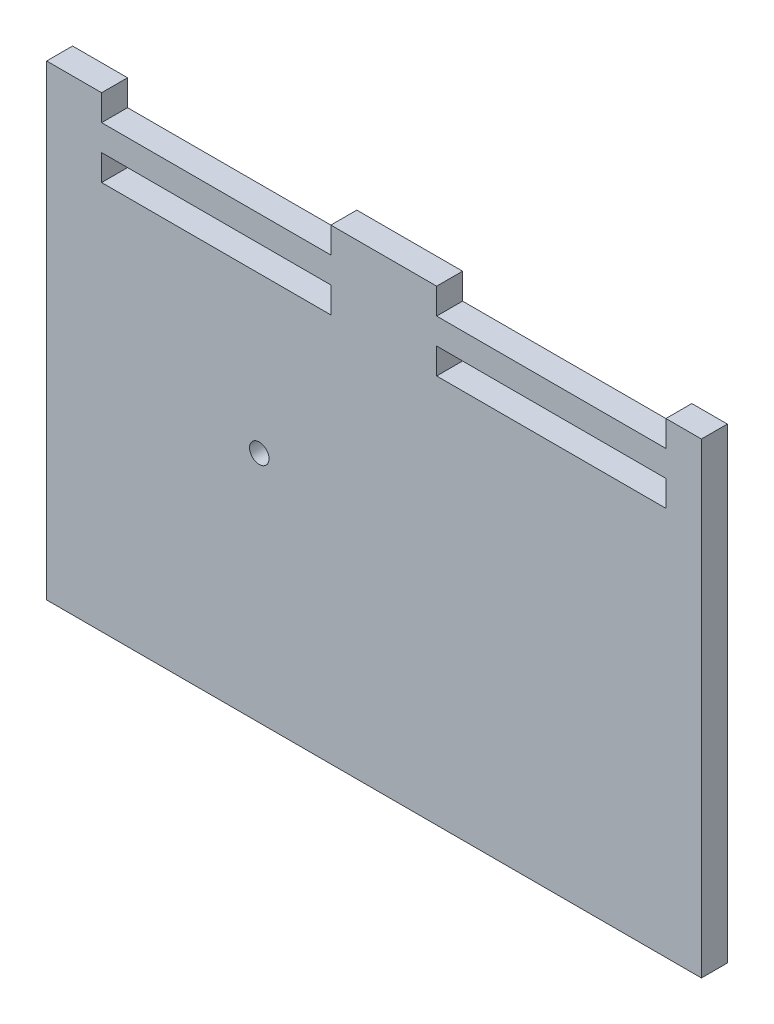
ISO-10303-21;
HEADER;
FILE_DESCRIPTION(('STEP AP214'),'2;1');
FILE_NAME('part.step','',(''),(''),'','','');
FILE_SCHEMA(('AUTOMOTIVE_DESIGN { 1 0 10303 214 1 1 1 1 }'));
ENDSEC;
DATA;
#1=APPLICATION_CONTEXT('core data for automotive mechanical design processes');
#2=APPLICATION_PROTOCOL_DEFINITION('international standard','automotive_design',2000,#1);
#3=PRODUCT_CONTEXT('',#1,'mechanical');
#4=PRODUCT('Part','Part','',(#3));
#5=PRODUCT_RELATED_PRODUCT_CATEGORY('part','',(#4));
#6=PRODUCT_DEFINITION_FORMATION('','',#4);
#7=PRODUCT_DEFINITION_CONTEXT('part definition',#1,'design');
#8=PRODUCT_DEFINITION('design','',#6,#7);
#9=PRODUCT_DEFINITION_SHAPE('','',#8);
#10=(LENGTH_UNIT() NAMED_UNIT(*) SI_UNIT(.MILLI.,.METRE.));
#11=(NAMED_UNIT(*) PLANE_ANGLE_UNIT() SI_UNIT($,.RADIAN.));
#12=(NAMED_UNIT(*) SI_UNIT($,.STERADIAN.) SOLID_ANGLE_UNIT());
#13=UNCERTAINTY_MEASURE_WITH_UNIT(LENGTH_MEASURE(1.E-05),#10,'distance_accuracy_value','');
#14=(GEOMETRIC_REPRESENTATION_CONTEXT(3) GLOBAL_UNCERTAINTY_ASSIGNED_CONTEXT((#13)) GLOBAL_UNIT_ASSIGNED_CONTEXT((#10,
#11,#12)) REPRESENTATION_CONTEXT('',''));
#15=CARTESIAN_POINT('',(0.,0.,0.));
#16=DIRECTION('',(0.,0.,1.));
#17=DIRECTION('',(1.,0.,0.));
#18=AXIS2_PLACEMENT_3D('',#15,#16,#17);
#19=CARTESIAN_POINT('',(0.,228.6,12.7));
#20=DIRECTION('',(0.,-1.,0.));
#21=DIRECTION('',(0.,0.,-1.));
#22=AXIS2_PLACEMENT_3D('',#19,#20,#21);
#23=PLANE('',#22);
#24=DIRECTION('',(0.,0.,1.));
#25=VECTOR('',#24,1.);
#26=CARTESIAN_POINT('',(290.576,228.6,0.));
#27=LINE('',#26,#25);
#28=CARTESIAN_POINT('',(290.576,228.6,0.));
#29=VERTEX_POINT('',#28);
#30=CARTESIAN_POINT('',(290.576,228.6,12.7));
#31=VERTEX_POINT('',#30);
#32=EDGE_CURVE('E258',#29,#31,#27,.T.);
#33=ORIENTED_EDGE('',*,*,#32,.T.);
#34=DIRECTION('',(-1.,0.,0.));
#35=VECTOR('',#34,1.);
#36=CARTESIAN_POINT('',(0.,228.6,12.7));
#37=LINE('',#36,#35);
#38=CARTESIAN_POINT('',(307.975,228.6,12.7));
#39=VERTEX_POINT('',#38);
#40=EDGE_CURVE('E11',#39,#31,#37,.T.);
#41=ORIENTED_EDGE('',*,*,#40,.F.);
#42=DIRECTION('',(0.,0.,1.));
#43=VECTOR('',#42,1.);
#44=CARTESIAN_POINT('',(307.975,228.6,0.));
#45=LINE('',#44,#43);
#46=CARTESIAN_POINT('',(307.975,228.6,0.));
#47=VERTEX_POINT('',#46);
#48=EDGE_CURVE('E199',#47,#39,#45,.T.);
#49=ORIENTED_EDGE('',*,*,#48,.F.);
#50=DIRECTION('',(-1.,0.,0.));
#51=VECTOR('',#50,1.);
#52=CARTESIAN_POINT('',(0.,228.6,0.));
#53=LINE('',#52,#51);
#54=EDGE_CURVE('E44',#47,#29,#53,.T.);
#55=ORIENTED_EDGE('',*,*,#54,.T.);
#56=EDGE_LOOP('',(#33,#41,#49,#55));
#57=FACE_BOUND('',#56,.T.);
#58=ADVANCED_FACE('F40',(#57),#23,.F.);
#59=CARTESIAN_POINT('',(178.308,228.6,12.7));
#60=VERTEX_POINT('',#59);
#61=CARTESIAN_POINT('',(126.492,228.6,12.7));
#62=VERTEX_POINT('',#61);
#63=EDGE_CURVE('E49',#60,#62,#37,.T.);
#64=ORIENTED_EDGE('',*,*,#63,.F.);
#65=DIRECTION('',(0.,0.,1.));
#66=VECTOR('',#65,1.);
#67=CARTESIAN_POINT('',(178.308,228.6,0.));
#68=LINE('',#67,#66);
#69=CARTESIAN_POINT('',(178.308,228.6,0.));
#70=VERTEX_POINT('',#69);
#71=EDGE_CURVE('E260',#70,#60,#68,.T.);
#72=ORIENTED_EDGE('',*,*,#71,.F.);
#73=CARTESIAN_POINT('',(126.492,228.6,0.));
#74=VERTEX_POINT('',#73);
#75=EDGE_CURVE('E196',#70,#74,#53,.T.);
#76=ORIENTED_EDGE('',*,*,#75,.T.);
#77=DIRECTION('',(0.,0.,1.));
#78=VECTOR('',#77,1.);
#79=CARTESIAN_POINT('',(126.492,228.6,0.));
#80=LINE('',#79,#78);
#81=EDGE_CURVE('E314',#74,#62,#80,.T.);
#82=ORIENTED_EDGE('',*,*,#81,.T.);
#83=EDGE_LOOP('',(#64,#72,#76,#82));
#84=FACE_BOUND('',#83,.T.);
#85=ADVANCED_FACE('F348',(#84),#23,.F.);
#86=CARTESIAN_POINT('',(0.,0.,12.7));
#87=DIRECTION('',(0.,0.,-1.));
#88=DIRECTION('',(-1.,0.,0.));
#89=AXIS2_PLACEMENT_3D('',#86,#87,#88);
#90=PLANE('',#89);
#91=DIRECTION('',(1.,0.,0.));
#92=VECTOR('',#91,1.);
#93=CARTESIAN_POINT('',(178.308,215.9,12.7));
#94=LINE('',#93,#92);
#95=CARTESIAN_POINT('',(178.308,215.9,12.7));
#96=VERTEX_POINT('',#95);
#97=CARTESIAN_POINT('',(290.576,215.9,12.7));
#98=VERTEX_POINT('',#97);
#99=EDGE_CURVE('E265',#96,#98,#94,.T.);
#100=ORIENTED_EDGE('',*,*,#99,.F.);
#101=DIRECTION('',(0.,-1.,0.));
#102=VECTOR('',#101,1.);
#103=CARTESIAN_POINT('',(178.308,228.6,12.7));
#104=LINE('',#103,#102);
#105=EDGE_CURVE('E269',#60,#96,#104,.T.);
#106=ORIENTED_EDGE('',*,*,#105,.F.);
#107=ORIENTED_EDGE('',*,*,#63,.T.);
#108=DIRECTION('',(0.,-1.,0.));
#109=VECTOR('',#108,1.);
#110=CARTESIAN_POINT('',(126.492,0.,12.7));
#111=LINE('',#110,#109);
#112=CARTESIAN_POINT('',(126.492,215.9,12.7));
#113=VERTEX_POINT('',#112);
#114=EDGE_CURVE('E272',#62,#113,#111,.T.);
#115=ORIENTED_EDGE('',*,*,#114,.T.);
#116=DIRECTION('',(1.,0.,0.));
#117=VECTOR('',#116,1.);
#118=CARTESIAN_POINT('',(0.,215.9,12.7));
#119=LINE('',#118,#117);
#120=CARTESIAN_POINT('',(14.224,215.9,12.7));
#121=VERTEX_POINT('',#120);
#122=EDGE_CURVE('E308',#121,#113,#119,.T.);
#123=ORIENTED_EDGE('',*,*,#122,.F.);
#124=DIRECTION('',(0.,-1.,0.));
#125=VECTOR('',#124,1.);
#126=CARTESIAN_POINT('',(14.224,0.,12.7));
#127=LINE('',#126,#125);
#128=CARTESIAN_POINT('',(14.224,228.6,12.7));
#129=VERTEX_POINT('',#128);
#130=EDGE_CURVE('E317',#129,#121,#127,.T.);
#131=ORIENTED_EDGE('',*,*,#130,.F.);
#132=CARTESIAN_POINT('',(-12.7,228.6,12.7));
#133=VERTEX_POINT('',#132);
#134=EDGE_CURVE('E51',#129,#133,#37,.T.);
#135=ORIENTED_EDGE('',*,*,#134,.T.);
#136=DIRECTION('',(0.,-1.,0.));
#137=VECTOR('',#136,1.);
#138=CARTESIAN_POINT('',(-12.7,0.,12.7));
#139=LINE('',#138,#137);
#140=CARTESIAN_POINT('',(-12.7,0.,12.7));
#141=VERTEX_POINT('',#140);
#142=EDGE_CURVE('E211',#133,#141,#139,.T.);
#143=ORIENTED_EDGE('',*,*,#142,.T.);
#144=DIRECTION('',(1.,0.,0.));
#145=VECTOR('',#144,1.);
#146=CARTESIAN_POINT('',(0.,0.,12.7));
#147=LINE('',#146,#145);
#148=CARTESIAN_POINT('',(307.975,0.,12.7));
#149=VERTEX_POINT('',#148);
#150=EDGE_CURVE('E195',#141,#149,#147,.T.);
#151=ORIENTED_EDGE('',*,*,#150,.T.);
#152=DIRECTION('',(0.,-1.,0.));
#153=VECTOR('',#152,1.);
#154=CARTESIAN_POINT('',(307.975,0.,12.7));
#155=LINE('',#154,#153);
#156=EDGE_CURVE('E207',#39,#149,#155,.T.);
#157=ORIENTED_EDGE('',*,*,#156,.F.);
#158=ORIENTED_EDGE('',*,*,#40,.T.);
#159=DIRECTION('',(0.,-1.,0.));
#160=VECTOR('',#159,1.);
#161=CARTESIAN_POINT('',(290.576,228.6,12.7));
#162=LINE('',#161,#160);
#163=EDGE_CURVE('E262',#31,#98,#162,.T.);
#164=ORIENTED_EDGE('',*,*,#163,.T.);
#165=EDGE_LOOP('',(#100,#106,#107,#115,#123,#131,#135,#143,#151,#157,#158,#164));
#166=FACE_BOUND('',#165,.T.);
#167=DIRECTION('',(0.,-1.,0.));
#168=VECTOR('',#167,1.);
#169=CARTESIAN_POINT('',(126.492,203.2,12.7));
#170=LINE('',#169,#168);
#171=CARTESIAN_POINT('',(126.492,203.2,12.7));
#172=VERTEX_POINT('',#171);
#173=CARTESIAN_POINT('',(126.492,190.5,12.7));
#174=VERTEX_POINT('',#173);
#175=EDGE_CURVE('E292',#172,#174,#170,.T.);
#176=ORIENTED_EDGE('',*,*,#175,.T.);
#177=DIRECTION('',(1.,0.,0.));
#178=VECTOR('',#177,1.);
#179=CARTESIAN_POINT('',(14.224,190.5,12.7));
#180=LINE('',#179,#178);
#181=CARTESIAN_POINT('',(14.224,190.5,12.7));
#182=VERTEX_POINT('',#181);
#183=EDGE_CURVE('E58',#182,#174,#180,.T.);
#184=ORIENTED_EDGE('',*,*,#183,.F.);
#185=DIRECTION('',(0.,-1.,0.));
#186=VECTOR('',#185,1.);
#187=CARTESIAN_POINT('',(14.224,203.2,12.7));
#188=LINE('',#187,#186);
#189=CARTESIAN_POINT('',(14.224,203.2,12.7));
#190=VERTEX_POINT('',#189);
#191=EDGE_CURVE('E285',#190,#182,#188,.T.);
#192=ORIENTED_EDGE('',*,*,#191,.F.);
#193=DIRECTION('',(1.,0.,0.));
#194=VECTOR('',#193,1.);
#195=CARTESIAN_POINT('',(14.224,203.2,12.7));
#196=LINE('',#195,#194);
#197=EDGE_CURVE('E288',#190,#172,#196,.T.);
#198=ORIENTED_EDGE('',*,*,#197,.T.);
#199=EDGE_LOOP('',(#176,#184,#192,#198));
#200=FACE_BOUND('',#199,.T.);
#201=DIRECTION('',(0.,-1.,0.));
#202=VECTOR('',#201,1.);
#203=CARTESIAN_POINT('',(290.576,203.2,12.7));
#204=LINE('',#203,#202);
#205=CARTESIAN_POINT('',(290.576,203.2,12.7));
#206=VERTEX_POINT('',#205);
#207=CARTESIAN_POINT('',(290.576,190.5,12.7));
#208=VERTEX_POINT('',#207);
#209=EDGE_CURVE('E240',#206,#208,#204,.T.);
#210=ORIENTED_EDGE('',*,*,#209,.T.);
#211=DIRECTION('',(1.,0.,0.));
#212=VECTOR('',#211,1.);
#213=CARTESIAN_POINT('',(178.308,190.5,12.7));
#214=LINE('',#213,#212);
#215=CARTESIAN_POINT('',(178.308,190.5,12.7));
#216=VERTEX_POINT('',#215);
#217=EDGE_CURVE('E66',#216,#208,#214,.T.);
#218=ORIENTED_EDGE('',*,*,#217,.F.);
#219=DIRECTION('',(0.,-1.,0.));
#220=VECTOR('',#219,1.);
#221=CARTESIAN_POINT('',(178.308,203.2,12.7));
#222=LINE('',#221,#220);
#223=CARTESIAN_POINT('',(178.308,203.2,12.7));
#224=VERTEX_POINT('',#223);
#225=EDGE_CURVE('E233',#224,#216,#222,.T.);
#226=ORIENTED_EDGE('',*,*,#225,.F.);
#227=DIRECTION('',(1.,0.,0.));
#228=VECTOR('',#227,1.);
#229=CARTESIAN_POINT('',(178.308,203.2,12.7));
#230=LINE('',#229,#228);
#231=EDGE_CURVE('E236',#224,#206,#230,.T.);
#232=ORIENTED_EDGE('',*,*,#231,.T.);
#233=EDGE_LOOP('',(#210,#218,#226,#232));
#234=FACE_BOUND('',#233,.T.);
#235=CARTESIAN_POINT('',(91.44,114.3,12.7));
#236=DIRECTION('',(0.,0.,1.));
#237=DIRECTION('',(1.,0.,0.));
#238=AXIS2_PLACEMENT_3D('',#235,#236,#237);
#239=CIRCLE('',#238,4.7625);
#240=CARTESIAN_POINT('',(96.2025,114.3,12.7));
#241=VERTEX_POINT('',#240);
#242=EDGE_CURVE('E324',#241,#241,#239,.T.);
#243=ORIENTED_EDGE('',*,*,#242,.F.);
#244=EDGE_LOOP('',(#243));
#245=FACE_BOUND('',#244,.T.);
#246=ADVANCED_FACE('F361',(#166,#200,#234,#245),#90,.F.);
#247=CARTESIAN_POINT('',(0.,0.,0.));
#248=DIRECTION('',(0.,0.,-1.));
#249=DIRECTION('',(-1.,0.,0.));
#250=AXIS2_PLACEMENT_3D('',#247,#248,#249);
#251=PLANE('',#250);
#252=DIRECTION('',(0.,-1.,0.));
#253=VECTOR('',#252,1.);
#254=CARTESIAN_POINT('',(178.308,228.6,0.));
#255=LINE('',#254,#253);
#256=CARTESIAN_POINT('',(178.308,215.9,0.));
#257=VERTEX_POINT('',#256);
#258=EDGE_CURVE('E266',#70,#257,#255,.T.);
#259=ORIENTED_EDGE('',*,*,#258,.T.);
#260=DIRECTION('',(1.,0.,0.));
#261=VECTOR('',#260,1.);
#262=CARTESIAN_POINT('',(178.308,215.9,0.));
#263=LINE('',#262,#261);
#264=CARTESIAN_POINT('',(290.576,215.9,0.));
#265=VERTEX_POINT('',#264);
#266=EDGE_CURVE('E274',#257,#265,#263,.T.);
#267=ORIENTED_EDGE('',*,*,#266,.T.);
#268=DIRECTION('',(0.,-1.,0.));
#269=VECTOR('',#268,1.);
#270=CARTESIAN_POINT('',(290.576,228.6,0.));
#271=LINE('',#270,#269);
#272=EDGE_CURVE('E192',#29,#265,#271,.T.);
#273=ORIENTED_EDGE('',*,*,#272,.F.);
#274=ORIENTED_EDGE('',*,*,#54,.F.);
#275=DIRECTION('',(0.,-1.,0.));
#276=VECTOR('',#275,1.);
#277=CARTESIAN_POINT('',(307.975,0.,0.));
#278=LINE('',#277,#276);
#279=CARTESIAN_POINT('',(307.975,0.,0.));
#280=VERTEX_POINT('',#279);
#281=EDGE_CURVE('E188',#47,#280,#278,.T.);
#282=ORIENTED_EDGE('',*,*,#281,.T.);
#283=DIRECTION('',(1.,0.,0.));
#284=VECTOR('',#283,1.);
#285=CARTESIAN_POINT('',(0.,0.,0.));
#286=LINE('',#285,#284);
#287=CARTESIAN_POINT('',(-12.7,0.,0.));
#288=VERTEX_POINT('',#287);
#289=EDGE_CURVE('E334',#288,#280,#286,.T.);
#290=ORIENTED_EDGE('',*,*,#289,.F.);
#291=DIRECTION('',(0.,-1.,0.));
#292=VECTOR('',#291,1.);
#293=CARTESIAN_POINT('',(-12.7,0.,0.));
#294=LINE('',#293,#292);
#295=CARTESIAN_POINT('',(-12.7,228.6,0.));
#296=VERTEX_POINT('',#295);
#297=EDGE_CURVE('E213',#296,#288,#294,.T.);
#298=ORIENTED_EDGE('',*,*,#297,.F.);
#299=CARTESIAN_POINT('',(14.224,228.6,0.));
#300=VERTEX_POINT('',#299);
#301=EDGE_CURVE('E197',#300,#296,#53,.T.);
#302=ORIENTED_EDGE('',*,*,#301,.F.);
#303=DIRECTION('',(0.,-1.,0.));
#304=VECTOR('',#303,1.);
#305=CARTESIAN_POINT('',(14.224,0.,0.));
#306=LINE('',#305,#304);
#307=CARTESIAN_POINT('',(14.224,215.9,0.));
#308=VERTEX_POINT('',#307);
#309=EDGE_CURVE('E307',#300,#308,#306,.T.);
#310=ORIENTED_EDGE('',*,*,#309,.T.);
#311=DIRECTION('',(1.,0.,0.));
#312=VECTOR('',#311,1.);
#313=CARTESIAN_POINT('',(0.,215.9,0.));
#314=LINE('',#313,#312);
#315=CARTESIAN_POINT('',(126.492,215.9,0.));
#316=VERTEX_POINT('',#315);
#317=EDGE_CURVE('E311',#308,#316,#314,.T.);
#318=ORIENTED_EDGE('',*,*,#317,.T.);
#319=DIRECTION('',(0.,-1.,0.));
#320=VECTOR('',#319,1.);
#321=CARTESIAN_POINT('',(126.492,0.,0.));
#322=LINE('',#321,#320);
#323=EDGE_CURVE('E305',#74,#316,#322,.T.);
#324=ORIENTED_EDGE('',*,*,#323,.F.);
#325=ORIENTED_EDGE('',*,*,#75,.F.);
#326=EDGE_LOOP('',(#259,#267,#273,#274,#282,#290,#298,#302,#310,#318,#324,#325));
#327=FACE_BOUND('',#326,.T.);
#328=DIRECTION('',(1.,0.,0.));
#329=VECTOR('',#328,1.);
#330=CARTESIAN_POINT('',(14.224,190.5,0.));
#331=LINE('',#330,#329);
#332=CARTESIAN_POINT('',(14.224,190.5,0.));
#333=VERTEX_POINT('',#332);
#334=CARTESIAN_POINT('',(126.492,190.5,0.));
#335=VERTEX_POINT('',#334);
#336=EDGE_CURVE('E289',#333,#335,#331,.T.);
#337=ORIENTED_EDGE('',*,*,#336,.T.);
#338=DIRECTION('',(0.,-1.,0.));
#339=VECTOR('',#338,1.);
#340=CARTESIAN_POINT('',(126.492,203.2,0.));
#341=LINE('',#340,#339);
#342=CARTESIAN_POINT('',(126.492,203.2,0.));
#343=VERTEX_POINT('',#342);
#344=EDGE_CURVE('E301',#343,#335,#341,.T.);
#345=ORIENTED_EDGE('',*,*,#344,.F.);
#346=DIRECTION('',(1.,0.,0.));
#347=VECTOR('',#346,1.);
#348=CARTESIAN_POINT('',(14.224,203.2,0.));
#349=LINE('',#348,#347);
#350=CARTESIAN_POINT('',(14.224,203.2,0.));
#351=VERTEX_POINT('',#350);
#352=EDGE_CURVE('E298',#351,#343,#349,.T.);
#353=ORIENTED_EDGE('',*,*,#352,.F.);
#354=DIRECTION('',(0.,-1.,0.));
#355=VECTOR('',#354,1.);
#356=CARTESIAN_POINT('',(14.224,203.2,0.));
#357=LINE('',#356,#355);
#358=EDGE_CURVE('E279',#351,#333,#357,.T.);
#359=ORIENTED_EDGE('',*,*,#358,.T.);
#360=EDGE_LOOP('',(#337,#345,#353,#359));
#361=FACE_BOUND('',#360,.T.);
#362=DIRECTION('',(1.,0.,0.));
#363=VECTOR('',#362,1.);
#364=CARTESIAN_POINT('',(178.308,190.5,0.));
#365=LINE('',#364,#363);
#366=CARTESIAN_POINT('',(178.308,190.5,0.));
#367=VERTEX_POINT('',#366);
#368=CARTESIAN_POINT('',(290.576,190.5,0.));
#369=VERTEX_POINT('',#368);
#370=EDGE_CURVE('E237',#367,#369,#365,.T.);
#371=ORIENTED_EDGE('',*,*,#370,.T.);
#372=DIRECTION('',(0.,-1.,0.));
#373=VECTOR('',#372,1.);
#374=CARTESIAN_POINT('',(290.576,203.2,0.));
#375=LINE('',#374,#373);
#376=CARTESIAN_POINT('',(290.576,203.2,0.));
#377=VERTEX_POINT('',#376);
#378=EDGE_CURVE('E250',#377,#369,#375,.T.);
#379=ORIENTED_EDGE('',*,*,#378,.F.);
#380=DIRECTION('',(1.,0.,0.));
#381=VECTOR('',#380,1.);
#382=CARTESIAN_POINT('',(178.308,203.2,0.));
#383=LINE('',#382,#381);
#384=CARTESIAN_POINT('',(178.308,203.2,0.));
#385=VERTEX_POINT('',#384);
#386=EDGE_CURVE('E247',#385,#377,#383,.T.);
#387=ORIENTED_EDGE('',*,*,#386,.F.);
#388=DIRECTION('',(0.,-1.,0.));
#389=VECTOR('',#388,1.);
#390=CARTESIAN_POINT('',(178.308,203.2,0.));
#391=LINE('',#390,#389);
#392=EDGE_CURVE('E227',#385,#367,#391,.T.);
#393=ORIENTED_EDGE('',*,*,#392,.T.);
#394=EDGE_LOOP('',(#371,#379,#387,#393));
#395=FACE_BOUND('',#394,.T.);
#396=CARTESIAN_POINT('',(91.44,114.3,0.));
#397=DIRECTION('',(0.,0.,1.));
#398=DIRECTION('',(1.,0.,0.));
#399=AXIS2_PLACEMENT_3D('',#396,#397,#398);
#400=CIRCLE('',#399,4.7625);
#401=CARTESIAN_POINT('',(96.2025,114.3,0.));
#402=VERTEX_POINT('',#401);
#403=EDGE_CURVE('E331',#402,#402,#400,.T.);
#404=ORIENTED_EDGE('',*,*,#403,.T.);
#405=EDGE_LOOP('',(#404));
#406=FACE_BOUND('',#405,.T.);
#407=ADVANCED_FACE('F185',(#327,#361,#395,#406),#251,.T.);
#408=CARTESIAN_POINT('',(0.,0.,12.7));
#409=DIRECTION('',(0.,1.,0.));
#410=DIRECTION('',(0.,0.,1.));
#411=AXIS2_PLACEMENT_3D('',#408,#409,#410);
#412=PLANE('',#411);
#413=ORIENTED_EDGE('',*,*,#289,.T.);
#414=DIRECTION('',(0.,0.,1.));
#415=VECTOR('',#414,1.);
#416=CARTESIAN_POINT('',(307.975,0.,0.));
#417=LINE('',#416,#415);
#418=EDGE_CURVE('E203',#280,#149,#417,.T.);
#419=ORIENTED_EDGE('',*,*,#418,.T.);
#420=ORIENTED_EDGE('',*,*,#150,.F.);
#421=DIRECTION('',(0.,0.,1.));
#422=VECTOR('',#421,1.);
#423=CARTESIAN_POINT('',(-12.7,0.,0.));
#424=LINE('',#423,#422);
#425=EDGE_CURVE('E219',#288,#141,#424,.T.);
#426=ORIENTED_EDGE('',*,*,#425,.F.);
#427=EDGE_LOOP('',(#413,#419,#420,#426));
#428=FACE_BOUND('',#427,.T.);
#429=ADVANCED_FACE('F42',(#428),#412,.F.);
#430=ORIENTED_EDGE('',*,*,#134,.F.);
#431=DIRECTION('',(0.,0.,1.));
#432=VECTOR('',#431,1.);
#433=CARTESIAN_POINT('',(14.224,228.6,0.));
#434=LINE('',#433,#432);
#435=EDGE_CURVE('E327',#300,#129,#434,.T.);
#436=ORIENTED_EDGE('',*,*,#435,.F.);
#437=ORIENTED_EDGE('',*,*,#301,.T.);
#438=DIRECTION('',(0.,0.,1.));
#439=VECTOR('',#438,1.);
#440=CARTESIAN_POINT('',(-12.7,228.6,0.));
#441=LINE('',#440,#439);
#442=EDGE_CURVE('E216',#296,#133,#441,.T.);
#443=ORIENTED_EDGE('',*,*,#442,.T.);
#444=EDGE_LOOP('',(#430,#436,#437,#443));
#445=FACE_BOUND('',#444,.T.);
#446=ADVANCED_FACE('F366',(#445),#23,.F.);
#447=CARTESIAN_POINT('',(91.44,114.3,0.));
#448=DIRECTION('',(0.,0.,1.));
#449=DIRECTION('',(1.,0.,0.));
#450=AXIS2_PLACEMENT_3D('',#447,#448,#449);
#451=CYLINDRICAL_SURFACE('',#450,4.7625);
#452=ORIENTED_EDGE('',*,*,#403,.F.);
#453=EDGE_LOOP('',(#452));
#454=FACE_BOUND('',#453,.T.);
#455=ORIENTED_EDGE('',*,*,#242,.T.);
#456=EDGE_LOOP('',(#455));
#457=FACE_BOUND('',#456,.T.);
#458=ADVANCED_FACE('F396',(#454,#457),#451,.F.);
#459=CARTESIAN_POINT('',(126.492,0.,0.));
#460=DIRECTION('',(-1.,0.,0.));
#461=DIRECTION('',(0.,0.,1.));
#462=AXIS2_PLACEMENT_3D('',#459,#460,#461);
#463=PLANE('',#462);
#464=ORIENTED_EDGE('',*,*,#114,.F.);
#465=ORIENTED_EDGE('',*,*,#81,.F.);
#466=ORIENTED_EDGE('',*,*,#323,.T.);
#467=DIRECTION('',(0.,0.,1.));
#468=VECTOR('',#467,1.);
#469=CARTESIAN_POINT('',(126.492,215.9,0.));
#470=LINE('',#469,#468);
#471=EDGE_CURVE('E322',#316,#113,#470,.T.);
#472=ORIENTED_EDGE('',*,*,#471,.T.);
#473=EDGE_LOOP('',(#464,#465,#466,#472));
#474=FACE_BOUND('',#473,.T.);
#475=ADVANCED_FACE('F353',(#474),#463,.T.);
#476=CARTESIAN_POINT('',(0.,215.9,0.));
#477=DIRECTION('',(0.,-1.,0.));
#478=DIRECTION('',(0.,0.,-1.));
#479=AXIS2_PLACEMENT_3D('',#476,#477,#478);
#480=PLANE('',#479);
#481=ORIENTED_EDGE('',*,*,#122,.T.);
#482=ORIENTED_EDGE('',*,*,#471,.F.);
#483=ORIENTED_EDGE('',*,*,#317,.F.);
#484=DIRECTION('',(0.,0.,1.));
#485=VECTOR('',#484,1.);
#486=CARTESIAN_POINT('',(14.224,215.9,0.));
#487=LINE('',#486,#485);
#488=EDGE_CURVE('E325',#308,#121,#487,.T.);
#489=ORIENTED_EDGE('',*,*,#488,.T.);
#490=EDGE_LOOP('',(#481,#482,#483,#489));
#491=FACE_BOUND('',#490,.T.);
#492=ADVANCED_FACE('F355',(#491),#480,.F.);
#493=CARTESIAN_POINT('',(14.224,0.,0.));
#494=DIRECTION('',(-1.,0.,0.));
#495=DIRECTION('',(0.,0.,1.));
#496=AXIS2_PLACEMENT_3D('',#493,#494,#495);
#497=PLANE('',#496);
#498=ORIENTED_EDGE('',*,*,#130,.T.);
#499=ORIENTED_EDGE('',*,*,#488,.F.);
#500=ORIENTED_EDGE('',*,*,#309,.F.);
#501=ORIENTED_EDGE('',*,*,#435,.T.);
#502=EDGE_LOOP('',(#498,#499,#500,#501));
#503=FACE_BOUND('',#502,.T.);
#504=ADVANCED_FACE('F413',(#503),#497,.F.);
#505=CARTESIAN_POINT('',(178.308,190.5,0.));
#506=DIRECTION('',(0.,-1.,0.));
#507=DIRECTION('',(1.,0.,0.));
#508=AXIS2_PLACEMENT_3D('',#505,#506,#507);
#509=PLANE('',#508);
#510=ORIENTED_EDGE('',*,*,#217,.T.);
#511=DIRECTION('',(0.,0.,1.));
#512=VECTOR('',#511,1.);
#513=CARTESIAN_POINT('',(290.576,190.5,0.));
#514=LINE('',#513,#512);
#515=EDGE_CURVE('E225',#369,#208,#514,.T.);
#516=ORIENTED_EDGE('',*,*,#515,.F.);
#517=ORIENTED_EDGE('',*,*,#370,.F.);
#518=DIRECTION('',(0.,0.,1.));
#519=VECTOR('',#518,1.);
#520=CARTESIAN_POINT('',(178.308,190.5,0.));
#521=LINE('',#520,#519);
#522=EDGE_CURVE('E222',#367,#216,#521,.T.);
#523=ORIENTED_EDGE('',*,*,#522,.T.);
#524=EDGE_LOOP('',(#510,#516,#517,#523));
#525=FACE_BOUND('',#524,.T.);
#526=ADVANCED_FACE('F416',(#525),#509,.F.);
#527=CARTESIAN_POINT('',(178.308,203.2,0.));
#528=DIRECTION('',(-1.,0.,0.));
#529=DIRECTION('',(0.,0.,1.));
#530=AXIS2_PLACEMENT_3D('',#527,#528,#529);
#531=PLANE('',#530);
#532=ORIENTED_EDGE('',*,*,#225,.T.);
#533=ORIENTED_EDGE('',*,*,#522,.F.);
#534=ORIENTED_EDGE('',*,*,#392,.F.);
#535=DIRECTION('',(0.,0.,1.));
#536=VECTOR('',#535,1.);
#537=CARTESIAN_POINT('',(178.308,203.2,0.));
#538=LINE('',#537,#536);
#539=EDGE_CURVE('E230',#385,#224,#538,.T.);
#540=ORIENTED_EDGE('',*,*,#539,.T.);
#541=EDGE_LOOP('',(#532,#533,#534,#540));
#542=FACE_BOUND('',#541,.T.);
#543=ADVANCED_FACE('F442',(#542),#531,.F.);
#544=CARTESIAN_POINT('',(178.308,203.2,0.));
#545=DIRECTION('',(0.,-1.,0.));
#546=DIRECTION('',(0.,0.,-1.));
#547=AXIS2_PLACEMENT_3D('',#544,#545,#546);
#548=PLANE('',#547);
#549=ORIENTED_EDGE('',*,*,#231,.F.);
#550=ORIENTED_EDGE('',*,*,#539,.F.);
#551=ORIENTED_EDGE('',*,*,#386,.T.);
#552=DIRECTION('',(0.,0.,1.));
#553=VECTOR('',#552,1.);
#554=CARTESIAN_POINT('',(290.576,203.2,0.));
#555=LINE('',#554,#553);
#556=EDGE_CURVE('E228',#377,#206,#555,.T.);
#557=ORIENTED_EDGE('',*,*,#556,.T.);
#558=EDGE_LOOP('',(#549,#550,#551,#557));
#559=FACE_BOUND('',#558,.T.);
#560=ADVANCED_FACE('F445',(#559),#548,.T.);
#561=CARTESIAN_POINT('',(290.576,203.2,0.));
#562=DIRECTION('',(-1.,0.,0.));
#563=DIRECTION('',(0.,-1.,0.));
#564=AXIS2_PLACEMENT_3D('',#561,#562,#563);
#565=PLANE('',#564);
#566=ORIENTED_EDGE('',*,*,#209,.F.);
#567=ORIENTED_EDGE('',*,*,#556,.F.);
#568=ORIENTED_EDGE('',*,*,#378,.T.);
#569=ORIENTED_EDGE('',*,*,#515,.T.);
#570=EDGE_LOOP('',(#566,#567,#568,#569));
#571=FACE_BOUND('',#570,.T.);
#572=ADVANCED_FACE('F429',(#571),#565,.T.);
#573=CARTESIAN_POINT('',(14.224,190.5,0.));
#574=DIRECTION('',(0.,-1.,0.));
#575=DIRECTION('',(1.,0.,0.));
#576=AXIS2_PLACEMENT_3D('',#573,#574,#575);
#577=PLANE('',#576);
#578=ORIENTED_EDGE('',*,*,#183,.T.);
#579=DIRECTION('',(0.,0.,1.));
#580=VECTOR('',#579,1.);
#581=CARTESIAN_POINT('',(126.492,190.5,0.));
#582=LINE('',#581,#580);
#583=EDGE_CURVE('E277',#335,#174,#582,.T.);
#584=ORIENTED_EDGE('',*,*,#583,.F.);
#585=ORIENTED_EDGE('',*,*,#336,.F.);
#586=DIRECTION('',(0.,0.,1.));
#587=VECTOR('',#586,1.);
#588=CARTESIAN_POINT('',(14.224,190.5,0.));
#589=LINE('',#588,#587);
#590=EDGE_CURVE('E244',#333,#182,#589,.T.);
#591=ORIENTED_EDGE('',*,*,#590,.T.);
#592=EDGE_LOOP('',(#578,#584,#585,#591));
#593=FACE_BOUND('',#592,.T.);
#594=ADVANCED_FACE('F423',(#593),#577,.F.);
#595=CARTESIAN_POINT('',(14.224,203.2,0.));
#596=DIRECTION('',(-1.,0.,0.));
#597=DIRECTION('',(0.,-1.,0.));
#598=AXIS2_PLACEMENT_3D('',#595,#596,#597);
#599=PLANE('',#598);
#600=ORIENTED_EDGE('',*,*,#191,.T.);
#601=ORIENTED_EDGE('',*,*,#590,.F.);
#602=ORIENTED_EDGE('',*,*,#358,.F.);
#603=DIRECTION('',(0.,0.,1.));
#604=VECTOR('',#603,1.);
#605=CARTESIAN_POINT('',(14.224,203.2,0.));
#606=LINE('',#605,#604);
#607=EDGE_CURVE('E282',#351,#190,#606,.T.);
#608=ORIENTED_EDGE('',*,*,#607,.T.);
#609=EDGE_LOOP('',(#600,#601,#602,#608));
#610=FACE_BOUND('',#609,.T.);
#611=ADVANCED_FACE('F420',(#610),#599,.F.);
#612=CARTESIAN_POINT('',(14.224,203.2,0.));
#613=DIRECTION('',(0.,-1.,0.));
#614=DIRECTION('',(1.,0.,0.));
#615=AXIS2_PLACEMENT_3D('',#612,#613,#614);
#616=PLANE('',#615);
#617=ORIENTED_EDGE('',*,*,#197,.F.);
#618=ORIENTED_EDGE('',*,*,#607,.F.);
#619=ORIENTED_EDGE('',*,*,#352,.T.);
#620=DIRECTION('',(0.,0.,1.));
#621=VECTOR('',#620,1.);
#622=CARTESIAN_POINT('',(126.492,203.2,0.));
#623=LINE('',#622,#621);
#624=EDGE_CURVE('E280',#343,#172,#623,.T.);
#625=ORIENTED_EDGE('',*,*,#624,.T.);
#626=EDGE_LOOP('',(#617,#618,#619,#625));
#627=FACE_BOUND('',#626,.T.);
#628=ADVANCED_FACE('F385',(#627),#616,.T.);
#629=CARTESIAN_POINT('',(126.492,203.2,0.));
#630=DIRECTION('',(-1.,0.,0.));
#631=DIRECTION('',(0.,0.,1.));
#632=AXIS2_PLACEMENT_3D('',#629,#630,#631);
#633=PLANE('',#632);
#634=ORIENTED_EDGE('',*,*,#175,.F.);
#635=ORIENTED_EDGE('',*,*,#624,.F.);
#636=ORIENTED_EDGE('',*,*,#344,.T.);
#637=ORIENTED_EDGE('',*,*,#583,.T.);
#638=EDGE_LOOP('',(#634,#635,#636,#637));
#639=FACE_BOUND('',#638,.T.);
#640=ADVANCED_FACE('F378',(#639),#633,.T.);
#641=CARTESIAN_POINT('',(178.308,228.6,0.));
#642=DIRECTION('',(-1.,0.,0.));
#643=DIRECTION('',(0.,0.,1.));
#644=AXIS2_PLACEMENT_3D('',#641,#642,#643);
#645=PLANE('',#644);
#646=ORIENTED_EDGE('',*,*,#105,.T.);
#647=DIRECTION('',(0.,0.,1.));
#648=VECTOR('',#647,1.);
#649=CARTESIAN_POINT('',(178.308,215.9,0.));
#650=LINE('',#649,#648);
#651=EDGE_CURVE('E254',#257,#96,#650,.T.);
#652=ORIENTED_EDGE('',*,*,#651,.F.);
#653=ORIENTED_EDGE('',*,*,#258,.F.);
#654=ORIENTED_EDGE('',*,*,#71,.T.);
#655=EDGE_LOOP('',(#646,#652,#653,#654));
#656=FACE_BOUND('',#655,.T.);
#657=ADVANCED_FACE('F376',(#656),#645,.F.);
#658=CARTESIAN_POINT('',(290.576,228.6,0.));
#659=DIRECTION('',(-1.,0.,0.));
#660=DIRECTION('',(0.,0.,1.));
#661=AXIS2_PLACEMENT_3D('',#658,#659,#660);
#662=PLANE('',#661);
#663=ORIENTED_EDGE('',*,*,#163,.F.);
#664=ORIENTED_EDGE('',*,*,#32,.F.);
#665=ORIENTED_EDGE('',*,*,#272,.T.);
#666=DIRECTION('',(0.,0.,1.));
#667=VECTOR('',#666,1.);
#668=CARTESIAN_POINT('',(290.576,215.9,0.));
#669=LINE('',#668,#667);
#670=EDGE_CURVE('E256',#265,#98,#669,.T.);
#671=ORIENTED_EDGE('',*,*,#670,.T.);
#672=EDGE_LOOP('',(#663,#664,#665,#671));
#673=FACE_BOUND('',#672,.T.);
#674=ADVANCED_FACE('F371',(#673),#662,.T.);
#675=CARTESIAN_POINT('',(178.308,215.9,0.));
#676=DIRECTION('',(0.,-1.,0.));
#677=DIRECTION('',(1.,0.,0.));
#678=AXIS2_PLACEMENT_3D('',#675,#676,#677);
#679=PLANE('',#678);
#680=ORIENTED_EDGE('',*,*,#99,.T.);
#681=ORIENTED_EDGE('',*,*,#670,.F.);
#682=ORIENTED_EDGE('',*,*,#266,.F.);
#683=ORIENTED_EDGE('',*,*,#651,.T.);
#684=EDGE_LOOP('',(#680,#681,#682,#683));
#685=FACE_BOUND('',#684,.T.);
#686=ADVANCED_FACE('F374',(#685),#679,.F.);
#687=CARTESIAN_POINT('',(-12.7,0.,0.));
#688=DIRECTION('',(-1.,0.,0.));
#689=DIRECTION('',(0.,-1.,0.));
#690=AXIS2_PLACEMENT_3D('',#687,#688,#689);
#691=PLANE('',#690);
#692=ORIENTED_EDGE('',*,*,#142,.F.);
#693=ORIENTED_EDGE('',*,*,#442,.F.);
#694=ORIENTED_EDGE('',*,*,#297,.T.);
#695=ORIENTED_EDGE('',*,*,#425,.T.);
#696=EDGE_LOOP('',(#692,#693,#694,#695));
#697=FACE_BOUND('',#696,.T.);
#698=ADVANCED_FACE('F369',(#697),#691,.T.);
#699=CARTESIAN_POINT('',(307.975,0.,0.));
#700=DIRECTION('',(-1.,0.,0.));
#701=DIRECTION('',(0.,-1.,0.));
#702=AXIS2_PLACEMENT_3D('',#699,#700,#701);
#703=PLANE('',#702);
#704=ORIENTED_EDGE('',*,*,#156,.T.);
#705=ORIENTED_EDGE('',*,*,#418,.F.);
#706=ORIENTED_EDGE('',*,*,#281,.F.);
#707=ORIENTED_EDGE('',*,*,#48,.T.);
#708=EDGE_LOOP('',(#704,#705,#706,#707));
#709=FACE_BOUND('',#708,.T.);
#710=ADVANCED_FACE('F205',(#709),#703,.F.);
#711=CLOSED_SHELL('',(#58,#85,#246,#407,#429,#446,#458,#475,#492,#504,#526,#543,#560,#572,#594,
#611,#628,#640,#657,#674,#686,#698,#710));
#712=MANIFOLD_SOLID_BREP('B2',#711);
#713=ADVANCED_BREP_SHAPE_REPRESENTATION('',(#18,#712),#14);
#714=SHAPE_DEFINITION_REPRESENTATION(#9,#713);
ENDSEC;
END-ISO-10303-21;
